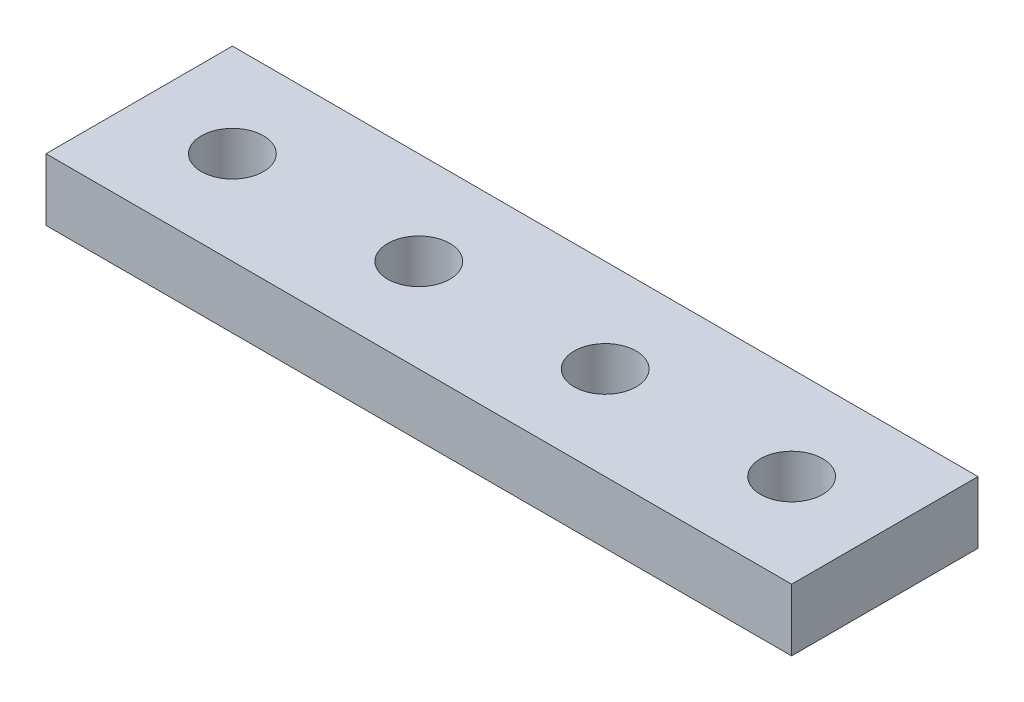
ISO-10303-21;
HEADER;
FILE_DESCRIPTION(('STEP AP214'),'2;1');
FILE_NAME('part.step','',(''),(''),'','','');
FILE_SCHEMA(('AUTOMOTIVE_DESIGN { 1 0 10303 214 1 1 1 1 }'));
ENDSEC;
DATA;
#1=APPLICATION_CONTEXT('core data for automotive mechanical design processes');
#2=APPLICATION_PROTOCOL_DEFINITION('international standard','automotive_design',2000,#1);
#3=PRODUCT_CONTEXT('',#1,'mechanical');
#4=PRODUCT('Part','Part','',(#3));
#5=PRODUCT_RELATED_PRODUCT_CATEGORY('part','',(#4));
#6=PRODUCT_DEFINITION_FORMATION('','',#4);
#7=PRODUCT_DEFINITION_CONTEXT('part definition',#1,'design');
#8=PRODUCT_DEFINITION('design','',#6,#7);
#9=PRODUCT_DEFINITION_SHAPE('','',#8);
#10=(LENGTH_UNIT() NAMED_UNIT(*) SI_UNIT(.MILLI.,.METRE.));
#11=(NAMED_UNIT(*) PLANE_ANGLE_UNIT() SI_UNIT($,.RADIAN.));
#12=(NAMED_UNIT(*) SI_UNIT($,.STERADIAN.) SOLID_ANGLE_UNIT());
#13=UNCERTAINTY_MEASURE_WITH_UNIT(LENGTH_MEASURE(1.E-05),#10,'distance_accuracy_value','');
#14=(GEOMETRIC_REPRESENTATION_CONTEXT(3) GLOBAL_UNCERTAINTY_ASSIGNED_CONTEXT((#13)) GLOBAL_UNIT_ASSIGNED_CONTEXT((#10,
#11,#12)) REPRESENTATION_CONTEXT('',''));
#15=CARTESIAN_POINT('',(0.,0.,0.));
#16=DIRECTION('',(0.,0.,1.));
#17=DIRECTION('',(1.,0.,0.));
#18=AXIS2_PLACEMENT_3D('',#15,#16,#17);
#19=CARTESIAN_POINT('',(0.,10.,0.));
#20=DIRECTION('',(1.,0.,0.));
#21=DIRECTION('',(0.,0.,-1.));
#22=AXIS2_PLACEMENT_3D('',#19,#20,#21);
#23=PLANE('',#22);
#24=DIRECTION('',(0.,0.,1.));
#25=VECTOR('',#24,1.);
#26=CARTESIAN_POINT('',(0.,0.,0.));
#27=LINE('',#26,#25);
#28=CARTESIAN_POINT('',(0.,0.,-30.));
#29=VERTEX_POINT('',#28);
#30=CARTESIAN_POINT('',(0.,0.,0.));
#31=VERTEX_POINT('',#30);
#32=EDGE_CURVE('E95',#29,#31,#27,.T.);
#33=ORIENTED_EDGE('',*,*,#32,.T.);
#34=DIRECTION('',(0.,-1.,0.));
#35=VECTOR('',#34,1.);
#36=CARTESIAN_POINT('',(0.,10.,0.));
#37=LINE('',#36,#35);
#38=CARTESIAN_POINT('',(0.,10.,0.));
#39=VERTEX_POINT('',#38);
#40=EDGE_CURVE('E11',#39,#31,#37,.T.);
#41=ORIENTED_EDGE('',*,*,#40,.F.);
#42=DIRECTION('',(0.,0.,1.));
#43=VECTOR('',#42,1.);
#44=CARTESIAN_POINT('',(0.,10.,0.));
#45=LINE('',#44,#43);
#46=CARTESIAN_POINT('',(0.,10.,-30.));
#47=VERTEX_POINT('',#46);
#48=EDGE_CURVE('E83',#47,#39,#45,.T.);
#49=ORIENTED_EDGE('',*,*,#48,.F.);
#50=DIRECTION('',(0.,-1.,0.));
#51=VECTOR('',#50,1.);
#52=CARTESIAN_POINT('',(0.,10.,-30.));
#53=LINE('',#52,#51);
#54=EDGE_CURVE('E91',#47,#29,#53,.T.);
#55=ORIENTED_EDGE('',*,*,#54,.T.);
#56=EDGE_LOOP('',(#33,#41,#49,#55));
#57=FACE_BOUND('',#56,.T.);
#58=ADVANCED_FACE('F32',(#57),#23,.F.);
#59=CARTESIAN_POINT('',(0.,10.,0.));
#60=DIRECTION('',(0.,0.,-1.));
#61=DIRECTION('',(-1.,0.,0.));
#62=AXIS2_PLACEMENT_3D('',#59,#60,#61);
#63=PLANE('',#62);
#64=DIRECTION('',(1.,0.,0.));
#65=VECTOR('',#64,1.);
#66=CARTESIAN_POINT('',(0.,0.,0.));
#67=LINE('',#66,#65);
#68=CARTESIAN_POINT('',(120.,0.,0.));
#69=VERTEX_POINT('',#68);
#70=EDGE_CURVE('E87',#31,#69,#67,.T.);
#71=ORIENTED_EDGE('',*,*,#70,.T.);
#72=DIRECTION('',(0.,-1.,0.));
#73=VECTOR('',#72,1.);
#74=CARTESIAN_POINT('',(120.,10.,0.));
#75=LINE('',#74,#73);
#76=CARTESIAN_POINT('',(120.,10.,0.));
#77=VERTEX_POINT('',#76);
#78=EDGE_CURVE('E40',#77,#69,#75,.T.);
#79=ORIENTED_EDGE('',*,*,#78,.F.);
#80=DIRECTION('',(1.,0.,0.));
#81=VECTOR('',#80,1.);
#82=CARTESIAN_POINT('',(0.,10.,0.));
#83=LINE('',#82,#81);
#84=EDGE_CURVE('E78',#39,#77,#83,.T.);
#85=ORIENTED_EDGE('',*,*,#84,.F.);
#86=ORIENTED_EDGE('',*,*,#40,.T.);
#87=EDGE_LOOP('',(#71,#79,#85,#86));
#88=FACE_BOUND('',#87,.T.);
#89=ADVANCED_FACE('F86',(#88),#63,.F.);
#90=CARTESIAN_POINT('',(120.,10.,0.));
#91=DIRECTION('',(-1.,0.,0.));
#92=DIRECTION('',(0.,0.,1.));
#93=AXIS2_PLACEMENT_3D('',#90,#91,#92);
#94=PLANE('',#93);
#95=DIRECTION('',(0.,0.,-1.));
#96=VECTOR('',#95,1.);
#97=CARTESIAN_POINT('',(120.,0.,0.));
#98=LINE('',#97,#96);
#99=CARTESIAN_POINT('',(120.,0.,-30.));
#100=VERTEX_POINT('',#99);
#101=EDGE_CURVE('E65',#69,#100,#98,.T.);
#102=ORIENTED_EDGE('',*,*,#101,.T.);
#103=DIRECTION('',(0.,-1.,0.));
#104=VECTOR('',#103,1.);
#105=CARTESIAN_POINT('',(120.,10.,-30.));
#106=LINE('',#105,#104);
#107=CARTESIAN_POINT('',(120.,10.,-30.));
#108=VERTEX_POINT('',#107);
#109=EDGE_CURVE('E88',#108,#100,#106,.T.);
#110=ORIENTED_EDGE('',*,*,#109,.F.);
#111=DIRECTION('',(0.,0.,-1.));
#112=VECTOR('',#111,1.);
#113=CARTESIAN_POINT('',(120.,10.,0.));
#114=LINE('',#113,#112);
#115=EDGE_CURVE('E81',#77,#108,#114,.T.);
#116=ORIENTED_EDGE('',*,*,#115,.F.);
#117=ORIENTED_EDGE('',*,*,#78,.T.);
#118=EDGE_LOOP('',(#102,#110,#116,#117));
#119=FACE_BOUND('',#118,.T.);
#120=ADVANCED_FACE('F89',(#119),#94,.F.);
#121=CARTESIAN_POINT('',(0.,10.,-30.));
#122=DIRECTION('',(0.,0.,1.));
#123=DIRECTION('',(1.,0.,0.));
#124=AXIS2_PLACEMENT_3D('',#121,#122,#123);
#125=PLANE('',#124);
#126=DIRECTION('',(-1.,0.,0.));
#127=VECTOR('',#126,1.);
#128=CARTESIAN_POINT('',(0.,0.,-30.));
#129=LINE('',#128,#127);
#130=EDGE_CURVE('E71',#100,#29,#129,.T.);
#131=ORIENTED_EDGE('',*,*,#130,.T.);
#132=ORIENTED_EDGE('',*,*,#54,.F.);
#133=DIRECTION('',(-1.,0.,0.));
#134=VECTOR('',#133,1.);
#135=CARTESIAN_POINT('',(0.,10.,-30.));
#136=LINE('',#135,#134);
#137=EDGE_CURVE('E48',#108,#47,#136,.T.);
#138=ORIENTED_EDGE('',*,*,#137,.F.);
#139=ORIENTED_EDGE('',*,*,#109,.T.);
#140=EDGE_LOOP('',(#131,#132,#138,#139));
#141=FACE_BOUND('',#140,.T.);
#142=ADVANCED_FACE('F103',(#141),#125,.F.);
#143=CARTESIAN_POINT('',(0.,10.,0.));
#144=DIRECTION('',(0.,-1.,0.));
#145=DIRECTION('',(0.,0.,-1.));
#146=AXIS2_PLACEMENT_3D('',#143,#144,#145);
#147=PLANE('',#146);
#148=CARTESIAN_POINT('',(105.,10.,-15.));
#149=DIRECTION('',(0.,1.,0.));
#150=DIRECTION('',(0.,0.,1.));
#151=AXIS2_PLACEMENT_3D('',#148,#149,#150);
#152=CIRCLE('',#151,5.);
#153=CARTESIAN_POINT('',(105.,10.,-10.));
#154=VERTEX_POINT('',#153);
#155=EDGE_CURVE('E127',#154,#154,#152,.T.);
#156=ORIENTED_EDGE('',*,*,#155,.F.);
#157=EDGE_LOOP('',(#156));
#158=FACE_BOUND('',#157,.T.);
#159=CARTESIAN_POINT('',(75.,10.,-15.));
#160=DIRECTION('',(0.,1.,0.));
#161=DIRECTION('',(0.,0.,1.));
#162=AXIS2_PLACEMENT_3D('',#159,#160,#161);
#163=CIRCLE('',#162,5.);
#164=CARTESIAN_POINT('',(75.,10.,-10.));
#165=VERTEX_POINT('',#164);
#166=EDGE_CURVE('E121',#165,#165,#163,.T.);
#167=ORIENTED_EDGE('',*,*,#166,.F.);
#168=EDGE_LOOP('',(#167));
#169=FACE_BOUND('',#168,.T.);
#170=CARTESIAN_POINT('',(45.,10.,-15.));
#171=DIRECTION('',(0.,1.,0.));
#172=DIRECTION('',(0.,0.,1.));
#173=AXIS2_PLACEMENT_3D('',#170,#171,#172);
#174=CIRCLE('',#173,5.);
#175=CARTESIAN_POINT('',(45.,10.,-10.));
#176=VERTEX_POINT('',#175);
#177=EDGE_CURVE('E115',#176,#176,#174,.T.);
#178=ORIENTED_EDGE('',*,*,#177,.F.);
#179=EDGE_LOOP('',(#178));
#180=FACE_BOUND('',#179,.T.);
#181=CARTESIAN_POINT('',(15.,10.,-15.));
#182=DIRECTION('',(0.,1.,0.));
#183=DIRECTION('',(0.,0.,1.));
#184=AXIS2_PLACEMENT_3D('',#181,#182,#183);
#185=CIRCLE('',#184,5.);
#186=CARTESIAN_POINT('',(15.,10.,-10.));
#187=VERTEX_POINT('',#186);
#188=EDGE_CURVE('E109',#187,#187,#185,.T.);
#189=ORIENTED_EDGE('',*,*,#188,.F.);
#190=EDGE_LOOP('',(#189));
#191=FACE_BOUND('',#190,.T.);
#192=ORIENTED_EDGE('',*,*,#48,.T.);
#193=ORIENTED_EDGE('',*,*,#84,.T.);
#194=ORIENTED_EDGE('',*,*,#115,.T.);
#195=ORIENTED_EDGE('',*,*,#137,.T.);
#196=EDGE_LOOP('',(#192,#193,#194,#195));
#197=FACE_BOUND('',#196,.T.);
#198=ADVANCED_FACE('F79',(#158,#169,#180,#191,#197),#147,.F.);
#199=CARTESIAN_POINT('',(0.,0.,0.));
#200=DIRECTION('',(0.,-1.,0.));
#201=DIRECTION('',(0.,0.,-1.));
#202=AXIS2_PLACEMENT_3D('',#199,#200,#201);
#203=PLANE('',#202);
#204=CARTESIAN_POINT('',(105.,0.,-15.));
#205=DIRECTION('',(0.,1.,0.));
#206=DIRECTION('',(0.,0.,1.));
#207=AXIS2_PLACEMENT_3D('',#204,#205,#206);
#208=CIRCLE('',#207,5.);
#209=CARTESIAN_POINT('',(105.,0.,-10.));
#210=VERTEX_POINT('',#209);
#211=EDGE_CURVE('E124',#210,#210,#208,.T.);
#212=ORIENTED_EDGE('',*,*,#211,.T.);
#213=EDGE_LOOP('',(#212));
#214=FACE_BOUND('',#213,.T.);
#215=CARTESIAN_POINT('',(75.,0.,-15.));
#216=DIRECTION('',(0.,1.,0.));
#217=DIRECTION('',(0.,0.,1.));
#218=AXIS2_PLACEMENT_3D('',#215,#216,#217);
#219=CIRCLE('',#218,5.);
#220=CARTESIAN_POINT('',(75.,0.,-10.));
#221=VERTEX_POINT('',#220);
#222=EDGE_CURVE('E118',#221,#221,#219,.T.);
#223=ORIENTED_EDGE('',*,*,#222,.T.);
#224=EDGE_LOOP('',(#223));
#225=FACE_BOUND('',#224,.T.);
#226=CARTESIAN_POINT('',(45.,0.,-15.));
#227=DIRECTION('',(0.,1.,0.));
#228=DIRECTION('',(0.,0.,1.));
#229=AXIS2_PLACEMENT_3D('',#226,#227,#228);
#230=CIRCLE('',#229,5.);
#231=CARTESIAN_POINT('',(45.,0.,-10.));
#232=VERTEX_POINT('',#231);
#233=EDGE_CURVE('E112',#232,#232,#230,.T.);
#234=ORIENTED_EDGE('',*,*,#233,.T.);
#235=EDGE_LOOP('',(#234));
#236=FACE_BOUND('',#235,.T.);
#237=CARTESIAN_POINT('',(15.,0.,-15.));
#238=DIRECTION('',(0.,1.,0.));
#239=DIRECTION('',(0.,0.,1.));
#240=AXIS2_PLACEMENT_3D('',#237,#238,#239);
#241=CIRCLE('',#240,5.);
#242=CARTESIAN_POINT('',(15.,0.,-10.));
#243=VERTEX_POINT('',#242);
#244=EDGE_CURVE('E98',#243,#243,#241,.T.);
#245=ORIENTED_EDGE('',*,*,#244,.T.);
#246=EDGE_LOOP('',(#245));
#247=FACE_BOUND('',#246,.T.);
#248=ORIENTED_EDGE('',*,*,#32,.F.);
#249=ORIENTED_EDGE('',*,*,#130,.F.);
#250=ORIENTED_EDGE('',*,*,#101,.F.);
#251=ORIENTED_EDGE('',*,*,#70,.F.);
#252=EDGE_LOOP('',(#248,#249,#250,#251));
#253=FACE_BOUND('',#252,.T.);
#254=ADVANCED_FACE('F106',(#214,#225,#236,#247,#253),#203,.T.);
#255=CARTESIAN_POINT('',(15.,0.,-15.));
#256=DIRECTION('',(0.,1.,0.));
#257=DIRECTION('',(0.,0.,1.));
#258=AXIS2_PLACEMENT_3D('',#255,#256,#257);
#259=CYLINDRICAL_SURFACE('',#258,5.);
#260=ORIENTED_EDGE('',*,*,#244,.F.);
#261=EDGE_LOOP('',(#260));
#262=FACE_BOUND('',#261,.T.);
#263=ORIENTED_EDGE('',*,*,#188,.T.);
#264=EDGE_LOOP('',(#263));
#265=FACE_BOUND('',#264,.T.);
#266=ADVANCED_FACE('F151',(#262,#265),#259,.F.);
#267=CARTESIAN_POINT('',(45.,0.,-15.));
#268=DIRECTION('',(0.,1.,0.));
#269=DIRECTION('',(0.,0.,1.));
#270=AXIS2_PLACEMENT_3D('',#267,#268,#269);
#271=CYLINDRICAL_SURFACE('',#270,5.);
#272=ORIENTED_EDGE('',*,*,#233,.F.);
#273=EDGE_LOOP('',(#272));
#274=FACE_BOUND('',#273,.T.);
#275=ORIENTED_EDGE('',*,*,#177,.T.);
#276=EDGE_LOOP('',(#275));
#277=FACE_BOUND('',#276,.T.);
#278=ADVANCED_FACE('F153',(#274,#277),#271,.F.);
#279=CARTESIAN_POINT('',(75.,0.,-15.));
#280=DIRECTION('',(0.,1.,0.));
#281=DIRECTION('',(0.,0.,1.));
#282=AXIS2_PLACEMENT_3D('',#279,#280,#281);
#283=CYLINDRICAL_SURFACE('',#282,5.);
#284=ORIENTED_EDGE('',*,*,#222,.F.);
#285=EDGE_LOOP('',(#284));
#286=FACE_BOUND('',#285,.T.);
#287=ORIENTED_EDGE('',*,*,#166,.T.);
#288=EDGE_LOOP('',(#287));
#289=FACE_BOUND('',#288,.T.);
#290=ADVANCED_FACE('F138',(#286,#289),#283,.F.);
#291=CARTESIAN_POINT('',(105.,0.,-15.));
#292=DIRECTION('',(0.,1.,0.));
#293=DIRECTION('',(0.,0.,1.));
#294=AXIS2_PLACEMENT_3D('',#291,#292,#293);
#295=CYLINDRICAL_SURFACE('',#294,5.);
#296=ORIENTED_EDGE('',*,*,#211,.F.);
#297=EDGE_LOOP('',(#296));
#298=FACE_BOUND('',#297,.T.);
#299=ORIENTED_EDGE('',*,*,#155,.T.);
#300=EDGE_LOOP('',(#299));
#301=FACE_BOUND('',#300,.T.);
#302=ADVANCED_FACE('F135',(#298,#301),#295,.F.);
#303=CLOSED_SHELL('',(#58,#89,#120,#142,#198,#254,#266,#278,#290,#302));
#304=MANIFOLD_SOLID_BREP('B2',#303);
#305=ADVANCED_BREP_SHAPE_REPRESENTATION('',(#18,#304),#14);
#306=SHAPE_DEFINITION_REPRESENTATION(#9,#305);
ENDSEC;
END-ISO-10303-21;
